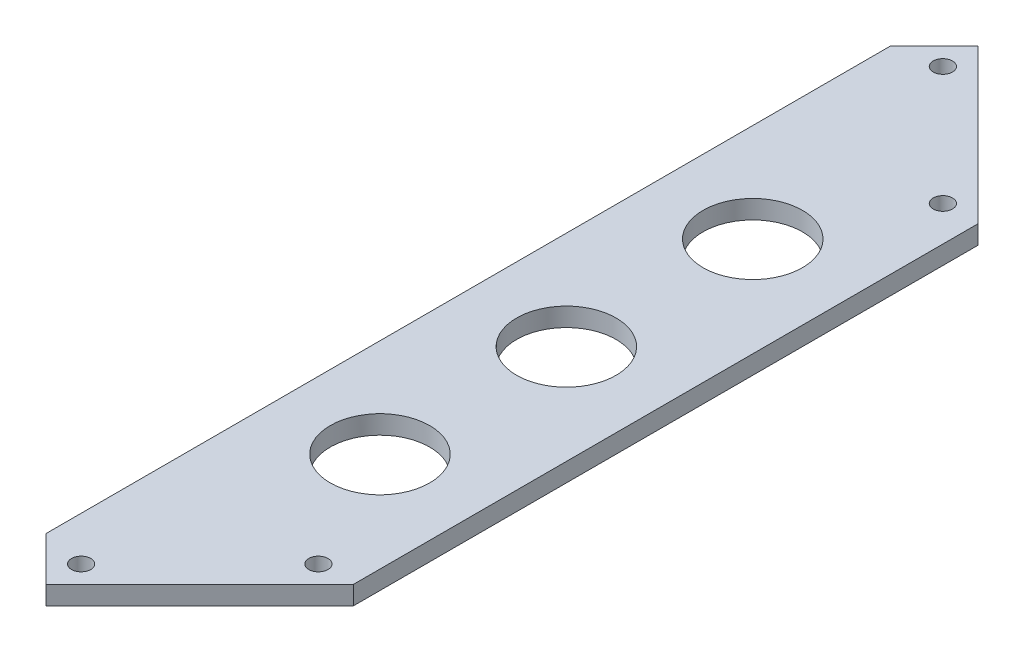
ISO-10303-21;
HEADER;
FILE_DESCRIPTION(('STEP AP214'),'2;1');
FILE_NAME('part.step','',(''),(''),'','','');
FILE_SCHEMA(('AUTOMOTIVE_DESIGN { 1 0 10303 214 1 1 1 1 }'));
ENDSEC;
DATA;
#1=APPLICATION_CONTEXT('core data for automotive mechanical design processes');
#2=APPLICATION_PROTOCOL_DEFINITION('international standard','automotive_design',2000,#1);
#3=PRODUCT_CONTEXT('',#1,'mechanical');
#4=PRODUCT('Part','Part','',(#3));
#5=PRODUCT_RELATED_PRODUCT_CATEGORY('part','',(#4));
#6=PRODUCT_DEFINITION_FORMATION('','',#4);
#7=PRODUCT_DEFINITION_CONTEXT('part definition',#1,'design');
#8=PRODUCT_DEFINITION('design','',#6,#7);
#9=PRODUCT_DEFINITION_SHAPE('','',#8);
#10=(LENGTH_UNIT() NAMED_UNIT(*) SI_UNIT(.MILLI.,.METRE.));
#11=(NAMED_UNIT(*) PLANE_ANGLE_UNIT() SI_UNIT($,.RADIAN.));
#12=(NAMED_UNIT(*) SI_UNIT($,.STERADIAN.) SOLID_ANGLE_UNIT());
#13=UNCERTAINTY_MEASURE_WITH_UNIT(LENGTH_MEASURE(1.E-05),#10,'distance_accuracy_value','');
#14=(GEOMETRIC_REPRESENTATION_CONTEXT(3) GLOBAL_UNCERTAINTY_ASSIGNED_CONTEXT((#13)) GLOBAL_UNIT_ASSIGNED_CONTEXT((#10,
#11,#12)) REPRESENTATION_CONTEXT('',''));
#15=CARTESIAN_POINT('',(0.,0.,0.));
#16=DIRECTION('',(0.,0.,1.));
#17=DIRECTION('',(1.,0.,0.));
#18=AXIS2_PLACEMENT_3D('',#15,#16,#17);
#19=CARTESIAN_POINT('',(0.,1.5,0.));
#20=DIRECTION('',(0.,1.,0.));
#21=DIRECTION('',(0.,0.,1.));
#22=AXIS2_PLACEMENT_3D('',#19,#20,#21);
#23=PLANE('',#22);
#24=CARTESIAN_POINT('',(59.,1.5,30.));
#25=DIRECTION('',(0.,1.,0.));
#26=DIRECTION('',(0.,0.,-1.));
#27=AXIS2_PLACEMENT_3D('',#24,#25,#26);
#28=CIRCLE('',#27,8.00000000000001);
#29=CARTESIAN_POINT('',(59.,1.5,22.));
#30=VERTEX_POINT('',#29);
#31=EDGE_CURVE('E218',#30,#30,#28,.T.);
#32=ORIENTED_EDGE('',*,*,#31,.F.);
#33=EDGE_LOOP('',(#32));
#34=FACE_BOUND('',#33,.T.);
#35=CARTESIAN_POINT('',(59.,1.5,-30.));
#36=DIRECTION('',(0.,1.,0.));
#37=DIRECTION('',(0.,0.,1.));
#38=AXIS2_PLACEMENT_3D('',#35,#36,#37);
#39=CIRCLE('',#38,8.00000000000001);
#40=CARTESIAN_POINT('',(59.,1.5,-22.));
#41=VERTEX_POINT('',#40);
#42=EDGE_CURVE('E217',#41,#41,#39,.T.);
#43=ORIENTED_EDGE('',*,*,#42,.F.);
#44=EDGE_LOOP('',(#43));
#45=FACE_BOUND('',#44,.T.);
#46=CARTESIAN_POINT('',(59.,1.5,0.));
#47=DIRECTION('',(0.,1.,0.));
#48=DIRECTION('',(0.,0.,1.));
#49=AXIS2_PLACEMENT_3D('',#46,#47,#48);
#50=CIRCLE('',#49,8.00000000000001);
#51=CARTESIAN_POINT('',(59.,1.5,8.00000000000001));
#52=VERTEX_POINT('',#51);
#53=EDGE_CURVE('E208',#52,#52,#50,.T.);
#54=ORIENTED_EDGE('',*,*,#53,.F.);
#55=EDGE_LOOP('',(#54));
#56=FACE_BOUND('',#55,.T.);
#57=DIRECTION('',(-0.707106781186544,0.,-0.707106781186551));
#58=VECTOR('',#57,1.);
#59=CARTESIAN_POINT('',(43.1801948466054,1.5,67.9289321881345));
#60=LINE('',#59,#58);
#61=CARTESIAN_POINT('',(50.2512626584708,1.5,75.));
#62=VERTEX_POINT('',#61);
#63=CARTESIAN_POINT('',(43.1801948466054,1.5,67.9289321881345));
#64=VERTEX_POINT('',#63);
#65=EDGE_CURVE('E109',#62,#64,#60,.T.);
#66=ORIENTED_EDGE('',*,*,#65,.F.);
#67=DIRECTION('',(-0.707106781186548,0.,0.707106781186547));
#68=VECTOR('',#67,1.);
#69=CARTESIAN_POINT('',(75.,1.5,50.2512626584709));
#70=LINE('',#69,#68);
#71=CARTESIAN_POINT('',(75.,1.5,50.2512626584709));
#72=VERTEX_POINT('',#71);
#73=EDGE_CURVE('E167',#72,#62,#70,.T.);
#74=ORIENTED_EDGE('',*,*,#73,.F.);
#75=DIRECTION('',(0.,0.,-1.));
#76=VECTOR('',#75,1.);
#77=CARTESIAN_POINT('',(75.,1.5,-75.));
#78=LINE('',#77,#76);
#79=CARTESIAN_POINT('',(75.,1.5,-50.2512626584709));
#80=VERTEX_POINT('',#79);
#81=EDGE_CURVE('E11',#72,#80,#78,.T.);
#82=ORIENTED_EDGE('',*,*,#81,.T.);
#83=DIRECTION('',(-0.707106781186548,0.,-0.707106781186547));
#84=VECTOR('',#83,1.);
#85=CARTESIAN_POINT('',(75.,1.5,-50.2512626584709));
#86=LINE('',#85,#84);
#87=CARTESIAN_POINT('',(50.2512626584708,1.5,-75.));
#88=VERTEX_POINT('',#87);
#89=EDGE_CURVE('E172',#80,#88,#86,.T.);
#90=ORIENTED_EDGE('',*,*,#89,.T.);
#91=DIRECTION('',(0.707106781186549,0.,-0.707106781186546));
#92=VECTOR('',#91,1.);
#93=CARTESIAN_POINT('',(50.2512626584708,1.5,-75.));
#94=LINE('',#93,#92);
#95=CARTESIAN_POINT('',(43.1801948466053,1.5,-67.9289321881346));
#96=VERTEX_POINT('',#95);
#97=EDGE_CURVE('E106',#96,#88,#94,.T.);
#98=ORIENTED_EDGE('',*,*,#97,.F.);
#99=DIRECTION('',(0.,0.,-1.));
#100=VECTOR('',#99,1.);
#101=CARTESIAN_POINT('',(43.1801948466053,1.5,-67.9289321881346));
#102=LINE('',#101,#100);
#103=EDGE_CURVE('E100',#64,#96,#102,.T.);
#104=ORIENTED_EDGE('',*,*,#103,.F.);
#105=EDGE_LOOP('',(#66,#74,#82,#90,#98,#104));
#106=FACE_BOUND('',#105,.T.);
#107=CARTESIAN_POINT('',(50.2512626584708,1.5,-69.3431457505077));
#108=DIRECTION('',(0.,1.,0.));
#109=DIRECTION('',(0.,0.,1.));
#110=AXIS2_PLACEMENT_3D('',#107,#108,#109);
#111=CIRCLE('',#110,1.55000000000001);
#112=CARTESIAN_POINT('',(50.2512626584708,1.5,-67.7931457505076));
#113=VERTEX_POINT('',#112);
#114=EDGE_CURVE('E131',#113,#113,#111,.F.);
#115=ORIENTED_EDGE('',*,*,#114,.T.);
#116=EDGE_LOOP('',(#115));
#117=FACE_BOUND('',#116,.T.);
#118=CARTESIAN_POINT('',(69.3431457505076,1.5,-50.2512626584709));
#119=DIRECTION('',(0.,1.,0.));
#120=DIRECTION('',(0.,0.,1.));
#121=AXIS2_PLACEMENT_3D('',#118,#119,#120);
#122=CIRCLE('',#121,1.55000000000001);
#123=CARTESIAN_POINT('',(69.3431457505076,1.5,-48.7012626584709));
#124=VERTEX_POINT('',#123);
#125=EDGE_CURVE('E142',#124,#124,#122,.T.);
#126=ORIENTED_EDGE('',*,*,#125,.F.);
#127=EDGE_LOOP('',(#126));
#128=FACE_BOUND('',#127,.T.);
#129=CARTESIAN_POINT('',(50.2512626584709,1.5,69.3431457505077));
#130=DIRECTION('',(0.,1.,0.));
#131=DIRECTION('',(0.,0.,1.));
#132=AXIS2_PLACEMENT_3D('',#129,#130,#131);
#133=CIRCLE('',#132,1.55000000000001);
#134=CARTESIAN_POINT('',(50.2512626584709,1.5,70.8931457505077));
#135=VERTEX_POINT('',#134);
#136=EDGE_CURVE('E132',#135,#135,#133,.T.);
#137=ORIENTED_EDGE('',*,*,#136,.F.);
#138=EDGE_LOOP('',(#137));
#139=FACE_BOUND('',#138,.T.);
#140=CARTESIAN_POINT('',(69.3431457505076,1.5,50.2512626584709));
#141=DIRECTION('',(0.,1.,0.));
#142=DIRECTION('',(0.,0.,1.));
#143=AXIS2_PLACEMENT_3D('',#140,#141,#142);
#144=CIRCLE('',#143,1.55000000000001);
#145=CARTESIAN_POINT('',(69.3431457505076,1.5,51.8012626584709));
#146=VERTEX_POINT('',#145);
#147=EDGE_CURVE('E141',#146,#146,#144,.F.);
#148=ORIENTED_EDGE('',*,*,#147,.T.);
#149=EDGE_LOOP('',(#148));
#150=FACE_BOUND('',#149,.T.);
#151=ADVANCED_FACE('F40',(#34,#45,#56,#106,#117,#128,#139,#150),#23,.T.);
#152=CARTESIAN_POINT('',(0.,-1.5,0.));
#153=DIRECTION('',(0.,1.,0.));
#154=DIRECTION('',(0.,0.,1.));
#155=AXIS2_PLACEMENT_3D('',#152,#153,#154);
#156=PLANE('',#155);
#157=CARTESIAN_POINT('',(59.,-1.5,30.));
#158=DIRECTION('',(0.,1.,0.));
#159=DIRECTION('',(0.,0.,1.));
#160=AXIS2_PLACEMENT_3D('',#157,#158,#159);
#161=CIRCLE('',#160,8.00000000000001);
#162=CARTESIAN_POINT('',(59.,-1.5,38.));
#163=VERTEX_POINT('',#162);
#164=EDGE_CURVE('E213',#163,#163,#161,.F.);
#165=ORIENTED_EDGE('',*,*,#164,.F.);
#166=EDGE_LOOP('',(#165));
#167=FACE_BOUND('',#166,.T.);
#168=CARTESIAN_POINT('',(59.,-1.5,-30.));
#169=DIRECTION('',(0.,1.,0.));
#170=DIRECTION('',(0.,0.,1.));
#171=AXIS2_PLACEMENT_3D('',#168,#169,#170);
#172=CIRCLE('',#171,8.00000000000001);
#173=CARTESIAN_POINT('',(59.,-1.5,-22.));
#174=VERTEX_POINT('',#173);
#175=EDGE_CURVE('E212',#174,#174,#172,.F.);
#176=ORIENTED_EDGE('',*,*,#175,.F.);
#177=EDGE_LOOP('',(#176));
#178=FACE_BOUND('',#177,.T.);
#179=CARTESIAN_POINT('',(59.,-1.5,0.));
#180=DIRECTION('',(0.,1.,0.));
#181=DIRECTION('',(0.,0.,1.));
#182=AXIS2_PLACEMENT_3D('',#179,#180,#181);
#183=CIRCLE('',#182,8.00000000000001);
#184=CARTESIAN_POINT('',(59.,-1.5,8.00000000000001));
#185=VERTEX_POINT('',#184);
#186=EDGE_CURVE('E116',#185,#185,#183,.F.);
#187=ORIENTED_EDGE('',*,*,#186,.F.);
#188=EDGE_LOOP('',(#187));
#189=FACE_BOUND('',#188,.T.);
#190=DIRECTION('',(0.707106781186548,0.,-0.707106781186547));
#191=VECTOR('',#190,1.);
#192=CARTESIAN_POINT('',(75.,-1.5,50.2512626584709));
#193=LINE('',#192,#191);
#194=CARTESIAN_POINT('',(50.2512626584708,-1.5,75.));
#195=VERTEX_POINT('',#194);
#196=CARTESIAN_POINT('',(75.,-1.5,50.2512626584709));
#197=VERTEX_POINT('',#196);
#198=EDGE_CURVE('E163',#195,#197,#193,.T.);
#199=ORIENTED_EDGE('',*,*,#198,.F.);
#200=DIRECTION('',(0.707106781186544,0.,0.707106781186551));
#201=VECTOR('',#200,1.);
#202=CARTESIAN_POINT('',(43.1801948466054,-1.5,67.9289321881345));
#203=LINE('',#202,#201);
#204=CARTESIAN_POINT('',(43.1801948466054,-1.5,67.9289321881345));
#205=VERTEX_POINT('',#204);
#206=EDGE_CURVE('E56',#205,#195,#203,.T.);
#207=ORIENTED_EDGE('',*,*,#206,.F.);
#208=DIRECTION('',(0.,0.,1.));
#209=VECTOR('',#208,1.);
#210=CARTESIAN_POINT('',(43.1801948466053,-1.5,-67.9289321881346));
#211=LINE('',#210,#209);
#212=CARTESIAN_POINT('',(43.1801948466053,-1.50000000000006,-67.9289321881346));
#213=VERTEX_POINT('',#212);
#214=EDGE_CURVE('E103',#213,#205,#211,.T.);
#215=ORIENTED_EDGE('',*,*,#214,.F.);
#216=DIRECTION('',(-0.707106781186549,0.,0.707106781186546));
#217=VECTOR('',#216,1.);
#218=CARTESIAN_POINT('',(50.2512626584708,-1.5,-75.));
#219=LINE('',#218,#217);
#220=CARTESIAN_POINT('',(50.2512626584708,-1.5,-75.));
#221=VERTEX_POINT('',#220);
#222=EDGE_CURVE('E127',#221,#213,#219,.T.);
#223=ORIENTED_EDGE('',*,*,#222,.F.);
#224=DIRECTION('',(0.707106781186548,0.,0.707106781186547));
#225=VECTOR('',#224,1.);
#226=CARTESIAN_POINT('',(75.,-1.5,-50.2512626584709));
#227=LINE('',#226,#225);
#228=CARTESIAN_POINT('',(75.,-1.5,-50.2512626584709));
#229=VERTEX_POINT('',#228);
#230=EDGE_CURVE('E175',#221,#229,#227,.T.);
#231=ORIENTED_EDGE('',*,*,#230,.T.);
#232=DIRECTION('',(0.,0.,-1.));
#233=VECTOR('',#232,1.);
#234=CARTESIAN_POINT('',(75.,-1.5,-75.));
#235=LINE('',#234,#233);
#236=EDGE_CURVE('E44',#197,#229,#235,.T.);
#237=ORIENTED_EDGE('',*,*,#236,.F.);
#238=EDGE_LOOP('',(#199,#207,#215,#223,#231,#237));
#239=FACE_BOUND('',#238,.T.);
#240=CARTESIAN_POINT('',(50.2512626584709,-1.5,69.3431457505077));
#241=DIRECTION('',(0.,1.,0.));
#242=DIRECTION('',(0.,0.,1.));
#243=AXIS2_PLACEMENT_3D('',#240,#241,#242);
#244=CIRCLE('',#243,1.55000000000001);
#245=CARTESIAN_POINT('',(50.2512626584709,-1.5,70.8931457505077));
#246=VERTEX_POINT('',#245);
#247=EDGE_CURVE('E136',#246,#246,#244,.F.);
#248=ORIENTED_EDGE('',*,*,#247,.F.);
#249=EDGE_LOOP('',(#248));
#250=FACE_BOUND('',#249,.T.);
#251=CARTESIAN_POINT('',(69.3431457505076,-1.5,-50.2512626584709));
#252=DIRECTION('',(0.,1.,0.));
#253=DIRECTION('',(0.,0.,1.));
#254=AXIS2_PLACEMENT_3D('',#251,#252,#253);
#255=CIRCLE('',#254,1.55000000000001);
#256=CARTESIAN_POINT('',(69.3431457505076,-1.5,-48.7012626584709));
#257=VERTEX_POINT('',#256);
#258=EDGE_CURVE('E137',#257,#257,#255,.F.);
#259=ORIENTED_EDGE('',*,*,#258,.F.);
#260=EDGE_LOOP('',(#259));
#261=FACE_BOUND('',#260,.T.);
#262=CARTESIAN_POINT('',(50.2512626584708,-1.5,-69.3431457505077));
#263=DIRECTION('',(0.,1.,0.));
#264=DIRECTION('',(0.,0.,1.));
#265=AXIS2_PLACEMENT_3D('',#262,#263,#264);
#266=CIRCLE('',#265,1.55000000000001);
#267=CARTESIAN_POINT('',(50.2512626584708,-1.5,-67.7931457505076));
#268=VERTEX_POINT('',#267);
#269=EDGE_CURVE('E146',#268,#268,#266,.T.);
#270=ORIENTED_EDGE('',*,*,#269,.T.);
#271=EDGE_LOOP('',(#270));
#272=FACE_BOUND('',#271,.T.);
#273=CARTESIAN_POINT('',(69.3431457505076,-1.5,50.2512626584709));
#274=DIRECTION('',(0.,1.,0.));
#275=DIRECTION('',(0.,0.,1.));
#276=AXIS2_PLACEMENT_3D('',#273,#274,#275);
#277=CIRCLE('',#276,1.55000000000001);
#278=CARTESIAN_POINT('',(69.3431457505076,-1.5,51.8012626584709));
#279=VERTEX_POINT('',#278);
#280=EDGE_CURVE('E159',#279,#279,#277,.T.);
#281=ORIENTED_EDGE('',*,*,#280,.T.);
#282=EDGE_LOOP('',(#281));
#283=FACE_BOUND('',#282,.T.);
#284=ADVANCED_FACE('F194',(#167,#178,#189,#239,#250,#261,#272,#283),#156,.F.);
#285=CARTESIAN_POINT('',(75.,1.5,-75.));
#286=DIRECTION('',(-1.,0.,0.));
#287=DIRECTION('',(0.,0.,1.));
#288=AXIS2_PLACEMENT_3D('',#285,#286,#287);
#289=PLANE('',#288);
#290=ORIENTED_EDGE('',*,*,#81,.F.);
#291=DIRECTION('',(0.,1.,0.));
#292=VECTOR('',#291,1.);
#293=CARTESIAN_POINT('',(75.,-36.5,50.2512626584709));
#294=LINE('',#293,#292);
#295=EDGE_CURVE('E164',#197,#72,#294,.T.);
#296=ORIENTED_EDGE('',*,*,#295,.F.);
#297=ORIENTED_EDGE('',*,*,#236,.T.);
#298=DIRECTION('',(0.,1.,0.));
#299=VECTOR('',#298,1.);
#300=CARTESIAN_POINT('',(75.,-36.5,-50.2512626584709));
#301=LINE('',#300,#299);
#302=EDGE_CURVE('E64',#229,#80,#301,.T.);
#303=ORIENTED_EDGE('',*,*,#302,.T.);
#304=EDGE_LOOP('',(#290,#296,#297,#303));
#305=FACE_BOUND('',#304,.T.);
#306=ADVANCED_FACE('F42',(#305),#289,.F.);
#307=CARTESIAN_POINT('',(75.,-36.5,-50.2512626584709));
#308=DIRECTION('',(0.707106781186547,0.,-0.707106781186548));
#309=DIRECTION('',(-0.707106781186548,0.,-0.707106781186547));
#310=AXIS2_PLACEMENT_3D('',#307,#308,#309);
#311=PLANE('',#310);
#312=DIRECTION('',(0.,1.,0.));
#313=VECTOR('',#312,1.);
#314=CARTESIAN_POINT('',(50.2512626584708,-36.5,-75.));
#315=LINE('',#314,#313);
#316=EDGE_CURVE('E180',#221,#88,#315,.T.);
#317=ORIENTED_EDGE('',*,*,#316,.T.);
#318=ORIENTED_EDGE('',*,*,#89,.F.);
#319=ORIENTED_EDGE('',*,*,#302,.F.);
#320=ORIENTED_EDGE('',*,*,#230,.F.);
#321=EDGE_LOOP('',(#317,#318,#319,#320));
#322=FACE_BOUND('',#321,.T.);
#323=ADVANCED_FACE('F198',(#322),#311,.T.);
#324=CARTESIAN_POINT('',(75.,-36.5,50.2512626584709));
#325=DIRECTION('',(-0.707106781186547,0.,-0.707106781186548));
#326=DIRECTION('',(-0.707106781186548,0.,0.707106781186547));
#327=AXIS2_PLACEMENT_3D('',#324,#325,#326);
#328=PLANE('',#327);
#329=ORIENTED_EDGE('',*,*,#198,.T.);
#330=ORIENTED_EDGE('',*,*,#295,.T.);
#331=ORIENTED_EDGE('',*,*,#73,.T.);
#332=DIRECTION('',(0.,1.,0.));
#333=VECTOR('',#332,1.);
#334=CARTESIAN_POINT('',(50.2512626584708,-36.5,75.));
#335=LINE('',#334,#333);
#336=EDGE_CURVE('E111',#195,#62,#335,.T.);
#337=ORIENTED_EDGE('',*,*,#336,.F.);
#338=EDGE_LOOP('',(#329,#330,#331,#337));
#339=FACE_BOUND('',#338,.T.);
#340=ADVANCED_FACE('F191',(#339),#328,.F.);
#341=CARTESIAN_POINT('',(50.2512626584708,-5.88406204335662,-69.3431457505077));
#342=DIRECTION('',(0.,1.,0.));
#343=DIRECTION('',(0.,0.,1.));
#344=AXIS2_PLACEMENT_3D('',#341,#342,#343);
#345=CYLINDRICAL_SURFACE('',#344,1.55000000000001);
#346=ORIENTED_EDGE('',*,*,#269,.F.);
#347=EDGE_LOOP('',(#346));
#348=FACE_BOUND('',#347,.T.);
#349=ORIENTED_EDGE('',*,*,#114,.F.);
#350=EDGE_LOOP('',(#349));
#351=FACE_BOUND('',#350,.T.);
#352=ADVANCED_FACE('F263',(#348,#351),#345,.F.);
#353=CARTESIAN_POINT('',(69.3431457505076,-5.88406204335662,-50.2512626584709));
#354=DIRECTION('',(0.,1.,0.));
#355=DIRECTION('',(0.,0.,1.));
#356=AXIS2_PLACEMENT_3D('',#353,#354,#355);
#357=CYLINDRICAL_SURFACE('',#356,1.55000000000001);
#358=ORIENTED_EDGE('',*,*,#258,.T.);
#359=EDGE_LOOP('',(#358));
#360=FACE_BOUND('',#359,.T.);
#361=ORIENTED_EDGE('',*,*,#125,.T.);
#362=EDGE_LOOP('',(#361));
#363=FACE_BOUND('',#362,.T.);
#364=ADVANCED_FACE('F259',(#360,#363),#357,.F.);
#365=CARTESIAN_POINT('',(50.2512626584709,-5.88406204335662,69.3431457505077));
#366=DIRECTION('',(0.,1.,0.));
#367=DIRECTION('',(0.,0.,1.));
#368=AXIS2_PLACEMENT_3D('',#365,#366,#367);
#369=CYLINDRICAL_SURFACE('',#368,1.55000000000001);
#370=ORIENTED_EDGE('',*,*,#247,.T.);
#371=EDGE_LOOP('',(#370));
#372=FACE_BOUND('',#371,.T.);
#373=ORIENTED_EDGE('',*,*,#136,.T.);
#374=EDGE_LOOP('',(#373));
#375=FACE_BOUND('',#374,.T.);
#376=ADVANCED_FACE('F256',(#372,#375),#369,.F.);
#377=CARTESIAN_POINT('',(69.3431457505076,-5.88406204335662,50.2512626584709));
#378=DIRECTION('',(0.,1.,0.));
#379=DIRECTION('',(0.,0.,1.));
#380=AXIS2_PLACEMENT_3D('',#377,#378,#379);
#381=CYLINDRICAL_SURFACE('',#380,1.55000000000001);
#382=ORIENTED_EDGE('',*,*,#280,.F.);
#383=EDGE_LOOP('',(#382));
#384=FACE_BOUND('',#383,.T.);
#385=ORIENTED_EDGE('',*,*,#147,.F.);
#386=EDGE_LOOP('',(#385));
#387=FACE_BOUND('',#386,.T.);
#388=ADVANCED_FACE('F255',(#384,#387),#381,.F.);
#389=CARTESIAN_POINT('',(43.1801948466054,-196.917191663224,67.9289321881345));
#390=DIRECTION('',(0.707106781186551,0.,-0.707106781186544));
#391=DIRECTION('',(-0.707106781186544,0.,-0.707106781186551));
#392=AXIS2_PLACEMENT_3D('',#389,#390,#391);
#393=PLANE('',#392);
#394=ORIENTED_EDGE('',*,*,#206,.T.);
#395=ORIENTED_EDGE('',*,*,#336,.T.);
#396=ORIENTED_EDGE('',*,*,#65,.T.);
#397=DIRECTION('',(0.,1.,0.));
#398=VECTOR('',#397,1.);
#399=CARTESIAN_POINT('',(43.1801948466054,-196.917191663224,67.9289321881345));
#400=LINE('',#399,#398);
#401=EDGE_CURVE('E95',#205,#64,#400,.T.);
#402=ORIENTED_EDGE('',*,*,#401,.F.);
#403=EDGE_LOOP('',(#394,#395,#396,#402));
#404=FACE_BOUND('',#403,.T.);
#405=ADVANCED_FACE('F110',(#404),#393,.F.);
#406=CARTESIAN_POINT('',(50.2512626584708,-196.917191663224,-75.));
#407=DIRECTION('',(0.707106781186546,0.,0.707106781186549));
#408=DIRECTION('',(0.707106781186549,0.,-0.707106781186546));
#409=AXIS2_PLACEMENT_3D('',#406,#407,#408);
#410=PLANE('',#409);
#411=ORIENTED_EDGE('',*,*,#222,.T.);
#412=DIRECTION('',(0.,1.,0.));
#413=VECTOR('',#412,1.);
#414=CARTESIAN_POINT('',(43.1801948466053,-196.917191663224,-67.9289321881346));
#415=LINE('',#414,#413);
#416=EDGE_CURVE('E105',#213,#96,#415,.T.);
#417=ORIENTED_EDGE('',*,*,#416,.T.);
#418=ORIENTED_EDGE('',*,*,#97,.T.);
#419=ORIENTED_EDGE('',*,*,#316,.F.);
#420=EDGE_LOOP('',(#411,#417,#418,#419));
#421=FACE_BOUND('',#420,.T.);
#422=ADVANCED_FACE('F200',(#421),#410,.F.);
#423=CARTESIAN_POINT('',(43.1801948466053,-196.917191663224,-67.9289321881346));
#424=DIRECTION('',(1.,0.,0.));
#425=DIRECTION('',(0.,0.,-1.));
#426=AXIS2_PLACEMENT_3D('',#423,#424,#425);
#427=PLANE('',#426);
#428=ORIENTED_EDGE('',*,*,#214,.T.);
#429=ORIENTED_EDGE('',*,*,#401,.T.);
#430=ORIENTED_EDGE('',*,*,#103,.T.);
#431=ORIENTED_EDGE('',*,*,#416,.F.);
#432=EDGE_LOOP('',(#428,#429,#430,#431));
#433=FACE_BOUND('',#432,.T.);
#434=ADVANCED_FACE('F97',(#433),#427,.F.);
#435=CARTESIAN_POINT('',(59.,-24.1274169979696,0.));
#436=DIRECTION('',(0.,1.,0.));
#437=DIRECTION('',(0.,0.,1.));
#438=AXIS2_PLACEMENT_3D('',#435,#436,#437);
#439=CYLINDRICAL_SURFACE('',#438,8.00000000000001);
#440=ORIENTED_EDGE('',*,*,#186,.T.);
#441=EDGE_LOOP('',(#440));
#442=FACE_BOUND('',#441,.T.);
#443=ORIENTED_EDGE('',*,*,#53,.T.);
#444=EDGE_LOOP('',(#443));
#445=FACE_BOUND('',#444,.T.);
#446=ADVANCED_FACE('F237',(#442,#445),#439,.F.);
#447=CARTESIAN_POINT('',(59.,-24.1274169979696,-30.));
#448=DIRECTION('',(0.,1.,0.));
#449=DIRECTION('',(0.,0.,1.));
#450=AXIS2_PLACEMENT_3D('',#447,#448,#449);
#451=CYLINDRICAL_SURFACE('',#450,8.00000000000001);
#452=ORIENTED_EDGE('',*,*,#175,.T.);
#453=EDGE_LOOP('',(#452));
#454=FACE_BOUND('',#453,.T.);
#455=ORIENTED_EDGE('',*,*,#42,.T.);
#456=EDGE_LOOP('',(#455));
#457=FACE_BOUND('',#456,.T.);
#458=ADVANCED_FACE('F229',(#454,#457),#451,.F.);
#459=CARTESIAN_POINT('',(59.,-24.1274169979696,30.));
#460=DIRECTION('',(0.,1.,0.));
#461=DIRECTION('',(0.,0.,1.));
#462=AXIS2_PLACEMENT_3D('',#459,#460,#461);
#463=CYLINDRICAL_SURFACE('',#462,8.00000000000001);
#464=ORIENTED_EDGE('',*,*,#164,.T.);
#465=EDGE_LOOP('',(#464));
#466=FACE_BOUND('',#465,.T.);
#467=ORIENTED_EDGE('',*,*,#31,.T.);
#468=EDGE_LOOP('',(#467));
#469=FACE_BOUND('',#468,.T.);
#470=ADVANCED_FACE('F245',(#466,#469),#463,.F.);
#471=CLOSED_SHELL('',(#151,#284,#306,#323,#340,#352,#364,#376,#388,#405,#422,#434,#446,#458,#470));
#472=MANIFOLD_SOLID_BREP('B2',#471);
#473=ADVANCED_BREP_SHAPE_REPRESENTATION('',(#18,#472),#14);
#474=SHAPE_DEFINITION_REPRESENTATION(#9,#473);
ENDSEC;
END-ISO-10303-21;
